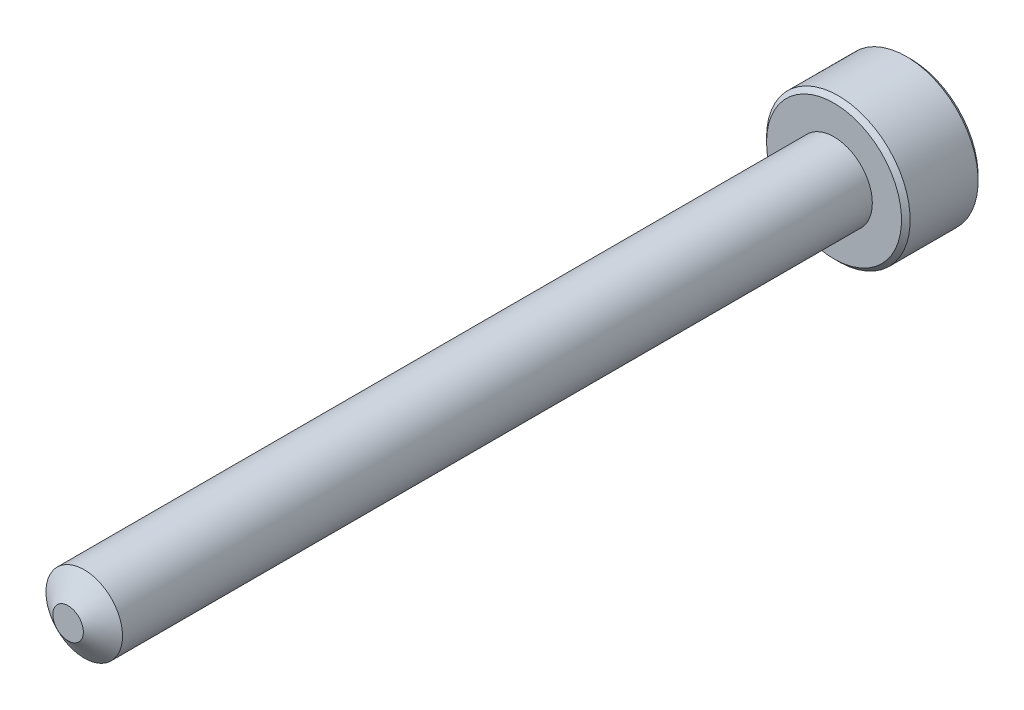
ISO-10303-21;
HEADER;
FILE_DESCRIPTION(('STEP AP214'),'2;1');
FILE_NAME('part.step','',(''),(''),'','','');
FILE_SCHEMA(('AUTOMOTIVE_DESIGN { 1 0 10303 214 1 1 1 1 }'));
ENDSEC;
DATA;
#1=APPLICATION_CONTEXT('core data for automotive mechanical design processes');
#2=APPLICATION_PROTOCOL_DEFINITION('international standard','automotive_design',2000,#1);
#3=PRODUCT_CONTEXT('',#1,'mechanical');
#4=PRODUCT('Part','Part','',(#3));
#5=PRODUCT_RELATED_PRODUCT_CATEGORY('part','',(#4));
#6=PRODUCT_DEFINITION_FORMATION('','',#4);
#7=PRODUCT_DEFINITION_CONTEXT('part definition',#1,'design');
#8=PRODUCT_DEFINITION('design','',#6,#7);
#9=PRODUCT_DEFINITION_SHAPE('','',#8);
#10=(LENGTH_UNIT() NAMED_UNIT(*) SI_UNIT(.MILLI.,.METRE.));
#11=(NAMED_UNIT(*) PLANE_ANGLE_UNIT() SI_UNIT($,.RADIAN.));
#12=(NAMED_UNIT(*) SI_UNIT($,.STERADIAN.) SOLID_ANGLE_UNIT());
#13=UNCERTAINTY_MEASURE_WITH_UNIT(LENGTH_MEASURE(1.E-05),#10,'distance_accuracy_value','');
#14=(GEOMETRIC_REPRESENTATION_CONTEXT(3) GLOBAL_UNCERTAINTY_ASSIGNED_CONTEXT((#13)) GLOBAL_UNIT_ASSIGNED_CONTEXT((#10,
#11,#12)) REPRESENTATION_CONTEXT('',''));
#15=CARTESIAN_POINT('',(0.,0.,0.));
#16=DIRECTION('',(0.,0.,1.));
#17=DIRECTION('',(1.,0.,0.));
#18=AXIS2_PLACEMENT_3D('',#15,#16,#17);
#19=CARTESIAN_POINT('',(0.,0.,-16.));
#20=DIRECTION('',(0.,0.,1.));
#21=DIRECTION('',(1.,0.,0.));
#22=AXIS2_PLACEMENT_3D('',#19,#20,#21);
#23=CYLINDRICAL_SURFACE('',#22,0.799999999999999);
#24=CARTESIAN_POINT('',(0.,0.,-0.337032062658148));
#25=DIRECTION('',(0.,0.,1.));
#26=DIRECTION('',(1.,0.,0.));
#27=AXIS2_PLACEMENT_3D('',#24,#25,#26);
#28=CIRCLE('',#27,0.799999999999999);
#29=CARTESIAN_POINT('',(0.799999999999999,0.,-0.337032062658148));
#30=VERTEX_POINT('',#29);
#31=EDGE_CURVE('E112',#30,#30,#28,.T.);
#32=ORIENTED_EDGE('',*,*,#31,.F.);
#33=EDGE_LOOP('',(#32));
#34=FACE_BOUND('',#33,.T.);
#35=CARTESIAN_POINT('',(0.,0.,-16.));
#36=DIRECTION('',(0.,0.,-1.));
#37=DIRECTION('',(-1.,0.,0.));
#38=AXIS2_PLACEMENT_3D('',#35,#36,#37);
#39=CIRCLE('',#38,0.799999999999999);
#40=CARTESIAN_POINT('',(-0.799999999999999,0.,-16.));
#41=VERTEX_POINT('',#40);
#42=EDGE_CURVE('E218',#41,#41,#39,.F.);
#43=ORIENTED_EDGE('',*,*,#42,.T.);
#44=EDGE_LOOP('',(#43));
#45=FACE_BOUND('',#44,.T.);
#46=ADVANCED_FACE('F38',(#34,#45),#23,.T.);
#47=CARTESIAN_POINT('',(0.,0.,0.));
#48=DIRECTION('',(0.,0.,-1.));
#49=DIRECTION('',(-1.,0.,0.));
#50=AXIS2_PLACEMENT_3D('',#47,#48,#49);
#51=CONICAL_SURFACE('',#50,0.318668331506579,0.959931088596884);
#52=ORIENTED_EDGE('',*,*,#31,.T.);
#53=EDGE_LOOP('',(#52));
#54=FACE_BOUND('',#53,.T.);
#55=CARTESIAN_POINT('',(0.,0.,0.));
#56=DIRECTION('',(0.,0.,1.));
#57=DIRECTION('',(1.,0.,0.));
#58=AXIS2_PLACEMENT_3D('',#55,#56,#57);
#59=CIRCLE('',#58,0.318668331506579);
#60=CARTESIAN_POINT('',(0.318668331506579,0.,0.));
#61=VERTEX_POINT('',#60);
#62=EDGE_CURVE('E216',#61,#61,#59,.T.);
#63=ORIENTED_EDGE('',*,*,#62,.F.);
#64=EDGE_LOOP('',(#63));
#65=FACE_BOUND('',#64,.T.);
#66=ADVANCED_FACE('F199',(#54,#65),#51,.T.);
#67=CARTESIAN_POINT('',(0.,0.,0.));
#68=DIRECTION('',(0.,0.,1.));
#69=DIRECTION('',(1.,0.,0.));
#70=AXIS2_PLACEMENT_3D('',#67,#68,#69);
#71=PLANE('',#70);
#72=ORIENTED_EDGE('',*,*,#62,.T.);
#73=EDGE_LOOP('',(#72));
#74=FACE_BOUND('',#73,.T.);
#75=ADVANCED_FACE('F196',(#74),#71,.T.);
#76=CARTESIAN_POINT('',(0.,0.,-17.6));
#77=DIRECTION('',(0.,0.,1.));
#78=DIRECTION('',(1.,0.,0.));
#79=AXIS2_PLACEMENT_3D('',#76,#77,#78);
#80=CYLINDRICAL_SURFACE('',#79,1.5);
#81=CARTESIAN_POINT('',(0.,0.,-17.51));
#82=DIRECTION('',(0.,0.,-1.));
#83=DIRECTION('',(-1.,0.,0.));
#84=AXIS2_PLACEMENT_3D('',#81,#82,#83);
#85=CIRCLE('',#84,1.5);
#86=CARTESIAN_POINT('',(-1.5,0.,-17.51));
#87=VERTEX_POINT('',#86);
#88=EDGE_CURVE('E46',#87,#87,#85,.F.);
#89=ORIENTED_EDGE('',*,*,#88,.T.);
#90=EDGE_LOOP('',(#89));
#91=FACE_BOUND('',#90,.T.);
#92=CARTESIAN_POINT('',(0.,0.,-16.09));
#93=DIRECTION('',(0.,0.,-1.));
#94=DIRECTION('',(-1.,0.,0.));
#95=AXIS2_PLACEMENT_3D('',#92,#93,#94);
#96=CIRCLE('',#95,1.5);
#97=CARTESIAN_POINT('',(-1.5,0.,-16.09));
#98=VERTEX_POINT('',#97);
#99=EDGE_CURVE('E175',#98,#98,#96,.T.);
#100=ORIENTED_EDGE('',*,*,#99,.T.);
#101=EDGE_LOOP('',(#100));
#102=FACE_BOUND('',#101,.T.);
#103=ADVANCED_FACE('F180',(#91,#102),#80,.T.);
#104=CARTESIAN_POINT('',(0.,0.,-17.6));
#105=DIRECTION('',(0.,0.,-1.));
#106=DIRECTION('',(-1.,0.,0.));
#107=AXIS2_PLACEMENT_3D('',#104,#105,#106);
#108=PLANE('',#107);
#109=CARTESIAN_POINT('',(0.,0.,-17.6));
#110=DIRECTION('',(0.,0.,-1.));
#111=DIRECTION('',(-1.,0.,0.));
#112=AXIS2_PLACEMENT_3D('',#109,#110,#111);
#113=CIRCLE('',#112,1.41);
#114=CARTESIAN_POINT('',(-1.41,0.,-17.6));
#115=VERTEX_POINT('',#114);
#116=EDGE_CURVE('E111',#115,#115,#113,.T.);
#117=ORIENTED_EDGE('',*,*,#116,.T.);
#118=EDGE_LOOP('',(#117));
#119=FACE_BOUND('',#118,.T.);
#120=CARTESIAN_POINT('',(0.,0.,-17.6));
#121=DIRECTION('',(0.,0.,-1.));
#122=DIRECTION('',(-1.,0.,0.));
#123=AXIS2_PLACEMENT_3D('',#120,#121,#122);
#124=CIRCLE('',#123,0.866025403784439);
#125=CARTESIAN_POINT('',(-0.749999999999989,0.433012701892241,-17.6));
#126=VERTEX_POINT('',#125);
#127=CARTESIAN_POINT('',(0.,0.86602540378444,-17.6));
#128=VERTEX_POINT('',#127);
#129=EDGE_CURVE('E92',#126,#128,#124,.T.);
#130=ORIENTED_EDGE('',*,*,#129,.F.);
#131=CARTESIAN_POINT('',(-0.749999999999989,-0.433012701892221,-17.6));
#132=VERTEX_POINT('',#131);
#133=EDGE_CURVE('E52',#132,#126,#124,.T.);
#134=ORIENTED_EDGE('',*,*,#133,.F.);
#135=CARTESIAN_POINT('',(0.,-0.866025403784439,-17.6));
#136=VERTEX_POINT('',#135);
#137=EDGE_CURVE('E278',#136,#132,#124,.T.);
#138=ORIENTED_EDGE('',*,*,#137,.F.);
#139=CARTESIAN_POINT('',(0.749999999999995,-0.433012701892229,-17.6));
#140=VERTEX_POINT('',#139);
#141=EDGE_CURVE('E59',#140,#136,#124,.T.);
#142=ORIENTED_EDGE('',*,*,#141,.F.);
#143=CARTESIAN_POINT('',(0.749999999999999,0.433012701892223,-17.6));
#144=VERTEX_POINT('',#143);
#145=EDGE_CURVE('E133',#144,#140,#124,.T.);
#146=ORIENTED_EDGE('',*,*,#145,.F.);
#147=EDGE_CURVE('E101',#128,#144,#124,.T.);
#148=ORIENTED_EDGE('',*,*,#147,.F.);
#149=EDGE_LOOP('',(#130,#134,#138,#142,#146,#148));
#150=FACE_BOUND('',#149,.T.);
#151=ADVANCED_FACE('F132',(#119,#150),#108,.T.);
#152=CARTESIAN_POINT('',(0.,0.,-16.));
#153=DIRECTION('',(0.,0.,-1.));
#154=DIRECTION('',(-1.,0.,0.));
#155=AXIS2_PLACEMENT_3D('',#152,#153,#154);
#156=PLANE('',#155);
#157=CARTESIAN_POINT('',(0.,0.,-16.));
#158=DIRECTION('',(0.,0.,-1.));
#159=DIRECTION('',(-1.,0.,0.));
#160=AXIS2_PLACEMENT_3D('',#157,#158,#159);
#161=CIRCLE('',#160,1.41);
#162=CARTESIAN_POINT('',(-1.41,0.,-16.));
#163=VERTEX_POINT('',#162);
#164=EDGE_CURVE('E11',#163,#163,#161,.F.);
#165=ORIENTED_EDGE('',*,*,#164,.T.);
#166=EDGE_LOOP('',(#165));
#167=FACE_BOUND('',#166,.T.);
#168=ORIENTED_EDGE('',*,*,#42,.F.);
#169=EDGE_LOOP('',(#168));
#170=FACE_BOUND('',#169,.T.);
#171=ADVANCED_FACE('F189',(#167,#170),#156,.F.);
#172=CARTESIAN_POINT('',(0.,0.,-17.6));
#173=DIRECTION('',(0.,0.,-1.));
#174=DIRECTION('',(-1.,0.,0.));
#175=AXIS2_PLACEMENT_3D('',#172,#173,#174);
#176=CONICAL_SURFACE('',#175,0.866025403784439,0.78539816339745);
#177=ORIENTED_EDGE('',*,*,#147,.T.);
#178=CARTESIAN_POINT('',(-0.000199999999998027,0.866140873838277,-17.6001154931448));
#179=CARTESIAN_POINT('',(0.0255899625576833,0.85125103201321,-17.5852341104639));
#180=CARTESIAN_POINT('',(0.0518112021286608,0.83611219228842,-17.571226265607));
#181=CARTESIAN_POINT('',(0.105279708235708,0.80524213589435,-17.5455775246823));
#182=CARTESIAN_POINT('',(0.132532067460574,0.789507978959821,-17.5339509117057));
#183=CARTESIAN_POINT('',(0.187485350381354,0.757780686272655,-17.5140340457722));
#184=CARTESIAN_POINT('',(0.215172256695511,0.741795643459148,-17.5056936940814));
#185=CARTESIAN_POINT('',(0.271155595130854,0.709473647943369,-17.4928427419614));
#186=CARTESIAN_POINT('',(0.299450314843645,0.693137683900544,-17.4883225405888));
#187=CARTESIAN_POINT('',(0.348210289268843,0.664986099540477,-17.4842458330974));
#188=CARTESIAN_POINT('',(0.368612065655573,0.653207128451652,-17.4836427966141));
#189=CARTESIAN_POINT('',(0.40937613469636,0.629671982217689,-17.4846545060155));
#190=CARTESIAN_POINT('',(0.429738417651455,0.617915812672249,-17.48626974099));
#191=CARTESIAN_POINT('',(0.490534543086824,0.582815153286453,-17.494336146973));
#192=CARTESIAN_POINT('',(0.5306658549961,0.5596453295527,-17.5040089358277));
#193=CARTESIAN_POINT('',(0.601110400354025,0.518974152327361,-17.5273563179723));
#194=CARTESIAN_POINT('',(0.631753572009085,0.501282308923488,-17.5398085580723));
#195=CARTESIAN_POINT('',(0.691839345804786,0.466591771248073,-17.5678596102309));
#196=CARTESIAN_POINT('',(0.721285488381586,0.449591032904762,-17.5834481859037));
#197=CARTESIAN_POINT('',(0.750199999999994,0.432897231838388,-17.6001154931448));
#198=B_SPLINE_CURVE_WITH_KNOTS('',3,(#178,#179,#180,#181,#182,#183,#184,#185,#186,#187,#188,
#189,#190,#191,#192,#193,#194,#195,#196,#197),.UNSPECIFIED.,.F.,.F.,(4,2,2,2,2,2,2,2,2,4),(0.,
0.0999419466095595,0.200466857654446,0.299393763705716,0.398071297300228,0.468665775681745,
0.539275821398837,0.680536257244565,0.792918418368068,0.904939568716021),.UNSPECIFIED.);
#199=EDGE_CURVE('E106',#128,#144,#198,.T.);
#200=ORIENTED_EDGE('',*,*,#199,.F.);
#201=EDGE_LOOP('',(#177,#200));
#202=FACE_BOUND('',#201,.T.);
#203=ADVANCED_FACE('F107',(#202),#176,.F.);
#204=ORIENTED_EDGE('',*,*,#145,.T.);
#205=CARTESIAN_POINT('',(0.749999999999995,-0.863604064848461,-17.8777892581354));
#206=CARTESIAN_POINT('',(0.749999999999995,-0.842575879734331,-17.8619149320084));
#207=CARTESIAN_POINT('',(0.749999999999995,-0.821430496291559,-17.846196265183));
#208=CARTESIAN_POINT('',(0.749999999999995,-0.778857857419017,-17.8151345206266));
#209=CARTESIAN_POINT('',(0.749999999999995,-0.757430533042235,-17.7997915374936));
#210=CARTESIAN_POINT('',(0.749999999999995,-0.692340710712935,-17.7542035802937));
#211=CARTESIAN_POINT('',(0.749999999999995,-0.648190081053413,-17.7246440917434));
#212=CARTESIAN_POINT('',(0.749999999999995,-0.55560718150175,-17.6666155826928));
#213=CARTESIAN_POINT('',(0.749999999999995,-0.507074363017995,-17.6383051093658));
#214=CARTESIAN_POINT('',(0.749999999999995,-0.407587529772336,-17.5865181117689));
#215=CARTESIAN_POINT('',(0.749999999999995,-0.356642419548471,-17.5630252915319));
#216=CARTESIAN_POINT('',(0.749999999999995,-0.280165468820771,-17.5342868995007));
#217=CARTESIAN_POINT('',(0.749999999999995,-0.255770023930572,-17.5260392748131));
#218=CARTESIAN_POINT('',(0.749999999999995,-0.206403277885132,-17.5114971754202));
#219=CARTESIAN_POINT('',(0.749999999999995,-0.181431937185907,-17.5052028352691));
#220=CARTESIAN_POINT('',(0.749999999999995,-0.106699879404925,-17.4899931738806));
#221=CARTESIAN_POINT('',(0.749999999999995,-0.056190717176218,-17.4843771847129));
#222=CARTESIAN_POINT('',(0.749999999999995,0.0430767231749055,-17.4836282564543));
#223=CARTESIAN_POINT('',(0.749999999999995,0.0918322434166276,-17.4881234514056));
#224=CARTESIAN_POINT('',(0.749999999999995,0.164112195698293,-17.501337307446));
#225=CARTESIAN_POINT('',(0.749999999999995,0.188278676879435,-17.5069014463821));
#226=CARTESIAN_POINT('',(0.749999999999995,0.23609448012033,-17.5199231661487));
#227=CARTESIAN_POINT('',(0.749999999999995,0.25974384527304,-17.5273805885477));
#228=CARTESIAN_POINT('',(0.749999999999995,0.334198278463818,-17.5536664694661));
#229=CARTESIAN_POINT('',(0.749999999999995,0.383940060445493,-17.5754903380484));
#230=CARTESIAN_POINT('',(0.749999999999995,0.481089225076663,-17.6240118041006));
#231=CARTESIAN_POINT('',(0.749999999999995,0.528487417973013,-17.6507269113103));
#232=CARTESIAN_POINT('',(0.749999999999995,0.619071540465247,-17.7058428511508));
#233=CARTESIAN_POINT('',(0.749999999999995,0.662349745300235,-17.7340939454522));
#234=CARTESIAN_POINT('',(0.749999999999995,0.726111623216221,-17.7777671470975));
#235=CARTESIAN_POINT('',(0.749999999999995,0.747090419255276,-17.7924788605167));
#236=CARTESIAN_POINT('',(0.749999999999995,0.788761341501856,-17.8222913841024));
#237=CARTESIAN_POINT('',(0.749999999999995,0.809453544535616,-17.837392086763));
#238=CARTESIAN_POINT('',(0.749999999999995,0.830026390097466,-17.8526540893047));
#239=B_SPLINE_CURVE_WITH_KNOTS('',3,(#205,#206,#207,#208,#209,#210,#211,#212,#213,#214,#215,
#216,#217,#218,#219,#220,#221,#222,#223,#224,#225,#226,#227,#228,#229,#230,#231,#232,#233,#234,
#235,#236,#237,#238),.UNSPECIFIED.,.F.,.F.,(4,2,2,2,2,2,2,2,2,2,2,2,2,2,2,2,4),(0.,
0.0790398443124695,0.158099390497593,0.317425208674101,0.485845155681378,0.653685658303956,
0.730869805636065,0.808059268704008,0.959469653380779,1.10540290447489,1.17973203111653,
1.25405493988072,1.41653726506053,1.57961304287542,1.73458511695815,1.81145152932466,
1.8882969211581),.UNSPECIFIED.);
#240=EDGE_CURVE('E100',#144,#140,#239,.F.);
#241=ORIENTED_EDGE('',*,*,#240,.F.);
#242=EDGE_LOOP('',(#204,#241));
#243=FACE_BOUND('',#242,.T.);
#244=ADVANCED_FACE('F284',(#243),#176,.F.);
#245=ORIENTED_EDGE('',*,*,#141,.T.);
#246=CARTESIAN_POINT('',(0.750199999999995,-0.432897231838378,-17.6001154931448));
#247=CARTESIAN_POINT('',(0.724410037442314,-0.447787073663446,-17.5852341104639));
#248=CARTESIAN_POINT('',(0.698188797871336,-0.462925913388236,-17.571226265607));
#249=CARTESIAN_POINT('',(0.64472029176429,-0.493795969782306,-17.5455775246823));
#250=CARTESIAN_POINT('',(0.617467932539423,-0.509530126716835,-17.5339509117057));
#251=CARTESIAN_POINT('',(0.562514649618644,-0.541257419404001,-17.5140340457722));
#252=CARTESIAN_POINT('',(0.534827743304488,-0.557242462217507,-17.5056936940814));
#253=CARTESIAN_POINT('',(0.478844404869145,-0.589564457733286,-17.4928427419614));
#254=CARTESIAN_POINT('',(0.450549685156353,-0.605900421776112,-17.4883225405888));
#255=CARTESIAN_POINT('',(0.401789710731155,-0.634052006136179,-17.4842458330974));
#256=CARTESIAN_POINT('',(0.381387934344426,-0.645830977225004,-17.4836427966141));
#257=CARTESIAN_POINT('',(0.340623865303638,-0.669366123458967,-17.4846545060155));
#258=CARTESIAN_POINT('',(0.320261582348544,-0.681122293004407,-17.48626974099));
#259=CARTESIAN_POINT('',(0.259465456913175,-0.716222952390203,-17.494336146973));
#260=CARTESIAN_POINT('',(0.2193341450039,-0.739392776123955,-17.5040089358277));
#261=CARTESIAN_POINT('',(0.148889599645974,-0.780063953349295,-17.5273563179723));
#262=CARTESIAN_POINT('',(0.118246427990914,-0.797755796753168,-17.5398085580722));
#263=CARTESIAN_POINT('',(0.0581606541952107,-0.832446334428584,-17.5678596102309));
#264=CARTESIAN_POINT('',(0.0287145116184097,-0.849447072771896,-17.5834481859037));
#265=CARTESIAN_POINT('',(-0.000199999999999266,-0.866140873838271,-17.6001154931448));
#266=B_SPLINE_CURVE_WITH_KNOTS('',3,(#246,#247,#248,#249,#250,#251,#252,#253,#254,#255,#256,
#257,#258,#259,#260,#261,#262,#263,#264,#265),.UNSPECIFIED.,.F.,.F.,(4,2,2,2,2,2,2,2,2,4),(0.,
0.0999419466095599,0.200466857654446,0.299393763705715,0.398071297300228,0.468665775681745,
0.539275821398836,0.680536257244562,0.792918418368068,0.904939568716026),.UNSPECIFIED.);
#267=EDGE_CURVE('E143',#140,#136,#266,.T.);
#268=ORIENTED_EDGE('',*,*,#267,.F.);
#269=EDGE_LOOP('',(#245,#268));
#270=FACE_BOUND('',#269,.T.);
#271=ADVANCED_FACE('F281',(#270),#176,.F.);
#272=ORIENTED_EDGE('',*,*,#137,.T.);
#273=CARTESIAN_POINT('',(0.000199999999999444,-0.866140873838272,-17.6001154931448));
#274=CARTESIAN_POINT('',(-0.025589962557682,-0.851251032013204,-17.5852341104639));
#275=CARTESIAN_POINT('',(-0.0518112021286595,-0.836112192288414,-17.571226265607));
#276=CARTESIAN_POINT('',(-0.105279708235706,-0.805242135894344,-17.5455775246823));
#277=CARTESIAN_POINT('',(-0.132532067460572,-0.789507978959815,-17.5339509117057));
#278=CARTESIAN_POINT('',(-0.187485350381353,-0.757780686272649,-17.5140340457722));
#279=CARTESIAN_POINT('',(-0.215172256695509,-0.741795643459143,-17.5056936940814));
#280=CARTESIAN_POINT('',(-0.271155595130852,-0.709473647943363,-17.4928427419614));
#281=CARTESIAN_POINT('',(-0.299450314843644,-0.693137683900538,-17.4883225405888));
#282=CARTESIAN_POINT('',(-0.348210289268842,-0.664986099540471,-17.4842458330974));
#283=CARTESIAN_POINT('',(-0.368612065655571,-0.653207128451646,-17.4836427966141));
#284=CARTESIAN_POINT('',(-0.409376134696359,-0.629671982217683,-17.4846545060155));
#285=CARTESIAN_POINT('',(-0.429738417651454,-0.617915812672243,-17.48626974099));
#286=CARTESIAN_POINT('',(-0.490534543086822,-0.582815153286447,-17.494336146973));
#287=CARTESIAN_POINT('',(-0.530665854996097,-0.559645329552695,-17.5040089358277));
#288=CARTESIAN_POINT('',(-0.601110400354022,-0.518974152327356,-17.5273563179723));
#289=CARTESIAN_POINT('',(-0.631753572009081,-0.501282308923483,-17.5398085580722));
#290=CARTESIAN_POINT('',(-0.691839345804781,-0.466591771248069,-17.5678596102309));
#291=CARTESIAN_POINT('',(-0.72128548838158,-0.449591032904758,-17.5834481859037));
#292=CARTESIAN_POINT('',(-0.750199999999988,-0.432897231838384,-17.6001154931448));
#293=B_SPLINE_CURVE_WITH_KNOTS('',3,(#273,#274,#275,#276,#277,#278,#279,#280,#281,#282,#283,
#284,#285,#286,#287,#288,#289,#290,#291,#292),.UNSPECIFIED.,.F.,.F.,(4,2,2,2,2,2,2,2,2,4),(0.,
0.0999419466095579,0.200466857654444,0.299393763705716,0.398071297300228,0.468665775681745,
0.539275821398836,0.680536257244562,0.792918418368064,0.904939568716016),.UNSPECIFIED.);
#294=EDGE_CURVE('E255',#136,#132,#293,.T.);
#295=ORIENTED_EDGE('',*,*,#294,.F.);
#296=EDGE_LOOP('',(#272,#295));
#297=FACE_BOUND('',#296,.T.);
#298=ADVANCED_FACE('F280',(#297),#176,.F.);
#299=ORIENTED_EDGE('',*,*,#133,.T.);
#300=CARTESIAN_POINT('',(-0.749999999999989,-0.863604064848471,-17.8777892581354));
#301=CARTESIAN_POINT('',(-0.749999999999989,-0.842575879734343,-17.8619149320084));
#302=CARTESIAN_POINT('',(-0.749999999999989,-0.821430496291571,-17.846196265183));
#303=CARTESIAN_POINT('',(-0.749999999999989,-0.77885785741903,-17.8151345206266));
#304=CARTESIAN_POINT('',(-0.749999999999989,-0.757430533042247,-17.7997915374936));
#305=CARTESIAN_POINT('',(-0.749999999999989,-0.692340710712945,-17.7542035802937));
#306=CARTESIAN_POINT('',(-0.749999999999989,-0.648190081053423,-17.7246440917434));
#307=CARTESIAN_POINT('',(-0.749999999999989,-0.555607181501759,-17.6666155826928));
#308=CARTESIAN_POINT('',(-0.749999999999989,-0.507074363018004,-17.6383051093658));
#309=CARTESIAN_POINT('',(-0.749999999999989,-0.407587529772343,-17.5865181117689));
#310=CARTESIAN_POINT('',(-0.749999999999989,-0.356642419548477,-17.5630252915318));
#311=CARTESIAN_POINT('',(-0.749999999999989,-0.280165468820776,-17.5342868995007));
#312=CARTESIAN_POINT('',(-0.749999999999989,-0.255770023930577,-17.526039274813));
#313=CARTESIAN_POINT('',(-0.749999999999989,-0.206403277885137,-17.5114971754202));
#314=CARTESIAN_POINT('',(-0.749999999999989,-0.181431937185912,-17.5052028352691));
#315=CARTESIAN_POINT('',(-0.749999999999989,-0.106699879404929,-17.4899931738806));
#316=CARTESIAN_POINT('',(-0.749999999999989,-0.0561907171762219,-17.4843771847129));
#317=CARTESIAN_POINT('',(-0.749999999999989,0.0430767231749017,-17.4836282564543));
#318=CARTESIAN_POINT('',(-0.749999999999989,0.0918322434166239,-17.4881234514056));
#319=CARTESIAN_POINT('',(-0.749999999999989,0.16411219569829,-17.501337307446));
#320=CARTESIAN_POINT('',(-0.749999999999989,0.188278676879432,-17.5069014463821));
#321=CARTESIAN_POINT('',(-0.749999999999989,0.236094480120326,-17.5199231661487));
#322=CARTESIAN_POINT('',(-0.749999999999989,0.259743845273036,-17.5273805885476));
#323=CARTESIAN_POINT('',(-0.749999999999989,0.334198278463814,-17.5536664694661));
#324=CARTESIAN_POINT('',(-0.749999999999989,0.383940060445489,-17.5754903380484));
#325=CARTESIAN_POINT('',(-0.749999999999989,0.481089225076657,-17.6240118041006));
#326=CARTESIAN_POINT('',(-0.749999999999989,0.528487417973007,-17.6507269113103));
#327=CARTESIAN_POINT('',(-0.749999999999989,0.619071540465239,-17.7058428511508));
#328=CARTESIAN_POINT('',(-0.749999999999989,0.662349745300228,-17.7340939454522));
#329=CARTESIAN_POINT('',(-0.749999999999989,0.726111623216211,-17.7777671470975));
#330=CARTESIAN_POINT('',(-0.749999999999989,0.747090419255265,-17.7924788605167));
#331=CARTESIAN_POINT('',(-0.749999999999989,0.788761341501844,-17.8222913841024));
#332=CARTESIAN_POINT('',(-0.749999999999989,0.809453544535604,-17.837392086763));
#333=CARTESIAN_POINT('',(-0.749999999999989,0.830026390097454,-17.8526540893047));
#334=B_SPLINE_CURVE_WITH_KNOTS('',3,(#300,#301,#302,#303,#304,#305,#306,#307,#308,#309,#310,
#311,#312,#313,#314,#315,#316,#317,#318,#319,#320,#321,#322,#323,#324,#325,#326,#327,#328,#329,
#330,#331,#332,#333),.UNSPECIFIED.,.F.,.F.,(4,2,2,2,2,2,2,2,2,2,2,2,2,2,2,2,4),(0.,
0.0790398443124674,0.158099390497591,0.317425208674103,0.485845155681381,0.653685658303964,
0.730869805636072,0.808059268704017,0.959469653380789,1.1054029044749,1.17973203111654,
1.25405493988072,1.41653726506054,1.57961304287543,1.73458511695815,1.81145152932466,
1.8882969211581),.UNSPECIFIED.);
#335=EDGE_CURVE('E122',#132,#126,#334,.T.);
#336=ORIENTED_EDGE('',*,*,#335,.F.);
#337=EDGE_LOOP('',(#299,#336));
#338=FACE_BOUND('',#337,.T.);
#339=ADVANCED_FACE('F293',(#338),#176,.F.);
#340=ORIENTED_EDGE('',*,*,#129,.T.);
#341=CARTESIAN_POINT('',(-0.750199999999989,0.432897231838387,-17.6001154931448));
#342=CARTESIAN_POINT('',(-0.724410037442308,0.447787073663454,-17.5852341104639));
#343=CARTESIAN_POINT('',(-0.698188797871331,0.462925913388244,-17.5712262656069));
#344=CARTESIAN_POINT('',(-0.644720291764285,0.493795969782314,-17.5455775246823));
#345=CARTESIAN_POINT('',(-0.617467932539419,0.509530126716842,-17.5339509117057));
#346=CARTESIAN_POINT('',(-0.56251464961864,0.541257419404008,-17.5140340457722));
#347=CARTESIAN_POINT('',(-0.534827743304484,0.557242462217514,-17.5056936940814));
#348=CARTESIAN_POINT('',(-0.478844404869142,0.589564457733293,-17.4928427419614));
#349=CARTESIAN_POINT('',(-0.450549685156351,0.605900421776118,-17.4883225405888));
#350=CARTESIAN_POINT('',(-0.401789710731153,0.634052006136185,-17.4842458330974));
#351=CARTESIAN_POINT('',(-0.381387934344424,0.64583097722501,-17.4836427966141));
#352=CARTESIAN_POINT('',(-0.340623865303636,0.669366123458973,-17.4846545060155));
#353=CARTESIAN_POINT('',(-0.320261582348541,0.681122293004412,-17.48626974099));
#354=CARTESIAN_POINT('',(-0.259465456913173,0.716222952390209,-17.494336146973));
#355=CARTESIAN_POINT('',(-0.219334145003897,0.739392776123962,-17.5040089358277));
#356=CARTESIAN_POINT('',(-0.148889599645971,0.780063953349301,-17.5273563179723));
#357=CARTESIAN_POINT('',(-0.11824642799091,0.797755796753174,-17.5398085580723));
#358=CARTESIAN_POINT('',(-0.0581606541952074,0.83244633442859,-17.5678596102309));
#359=CARTESIAN_POINT('',(-0.0287145116184069,0.849447072771902,-17.5834481859038));
#360=CARTESIAN_POINT('',(0.000200000000002174,0.866140873838278,-17.6001154931448));
#361=B_SPLINE_CURVE_WITH_KNOTS('',3,(#341,#342,#343,#344,#345,#346,#347,#348,#349,#350,#351,
#352,#353,#354,#355,#356,#357,#358,#359,#360),.UNSPECIFIED.,.F.,.F.,(4,2,2,2,2,2,2,2,2,4),(0.,
0.0999419466095585,0.200466857654441,0.29939376370571,0.398071297300221,0.468665775681739,
0.53927582139883,0.680536257244557,0.792918418368064,0.904939568716021),.UNSPECIFIED.);
#362=EDGE_CURVE('E96',#126,#128,#361,.T.);
#363=ORIENTED_EDGE('',*,*,#362,.F.);
#364=EDGE_LOOP('',(#340,#363));
#365=FACE_BOUND('',#364,.T.);
#366=ADVANCED_FACE('F94',(#365),#176,.F.);
#367=CARTESIAN_POINT('',(-1.49999999999999,0.,-16.475));
#368=DIRECTION('',(0.,0.,1.));
#369=DIRECTION('',(1.,0.,0.));
#370=AXIS2_PLACEMENT_3D('',#367,#368,#369);
#371=PLANE('',#370);
#372=DIRECTION('',(0.866025403784438,0.500000000000001,0.));
#373=VECTOR('',#372,1.);
#374=CARTESIAN_POINT('',(-0.749999999999989,0.433012701892225,-16.475));
#375=LINE('',#374,#373);
#376=CARTESIAN_POINT('',(-0.749999999999989,0.433012701892225,-16.475));
#377=VERTEX_POINT('',#376);
#378=CARTESIAN_POINT('',(0.,0.866025403784439,-16.475));
#379=VERTEX_POINT('',#378);
#380=EDGE_CURVE('E121',#377,#379,#375,.T.);
#381=ORIENTED_EDGE('',*,*,#380,.T.);
#382=DIRECTION('',(0.866025403784439,-0.499999999999999,0.));
#383=VECTOR('',#382,1.);
#384=CARTESIAN_POINT('',(0.,0.866025403784439,-16.475));
#385=LINE('',#384,#383);
#386=CARTESIAN_POINT('',(0.749999999999995,0.433012701892225,-16.475));
#387=VERTEX_POINT('',#386);
#388=EDGE_CURVE('E126',#379,#387,#385,.T.);
#389=ORIENTED_EDGE('',*,*,#388,.T.);
#390=DIRECTION('',(0.,-1.,0.));
#391=VECTOR('',#390,1.);
#392=CARTESIAN_POINT('',(0.749999999999995,0.433012701892225,-16.475));
#393=LINE('',#392,#391);
#394=CARTESIAN_POINT('',(0.749999999999995,-0.433012701892216,-16.475));
#395=VERTEX_POINT('',#394);
#396=EDGE_CURVE('E241',#387,#395,#393,.T.);
#397=ORIENTED_EDGE('',*,*,#396,.T.);
#398=DIRECTION('',(-0.866025403784438,-0.500000000000001,0.));
#399=VECTOR('',#398,1.);
#400=CARTESIAN_POINT('',(0.749999999999995,-0.433012701892216,-16.475));
#401=LINE('',#400,#399);
#402=CARTESIAN_POINT('',(0.,-0.866025403784434,-16.475));
#403=VERTEX_POINT('',#402);
#404=EDGE_CURVE('E238',#395,#403,#401,.T.);
#405=ORIENTED_EDGE('',*,*,#404,.T.);
#406=DIRECTION('',(-0.866025403784439,0.5,0.));
#407=VECTOR('',#406,1.);
#408=CARTESIAN_POINT('',(0.,-0.866025403784434,-16.475));
#409=LINE('',#408,#407);
#410=CARTESIAN_POINT('',(-0.749999999999989,-0.433012701892221,-16.475));
#411=VERTEX_POINT('',#410);
#412=EDGE_CURVE('E235',#403,#411,#409,.T.);
#413=ORIENTED_EDGE('',*,*,#412,.T.);
#414=DIRECTION('',(0.,1.,0.));
#415=VECTOR('',#414,1.);
#416=CARTESIAN_POINT('',(-0.749999999999989,-0.433012701892221,-16.475));
#417=LINE('',#416,#415);
#418=EDGE_CURVE('E129',#411,#377,#417,.T.);
#419=ORIENTED_EDGE('',*,*,#418,.T.);
#420=EDGE_LOOP('',(#381,#389,#397,#405,#413,#419));
#421=FACE_BOUND('',#420,.T.);
#422=ADVANCED_FACE('F163',(#421),#371,.F.);
#423=CARTESIAN_POINT('',(0.,0.866025403784439,-16.475));
#424=DIRECTION('',(0.499999999999999,0.866025403784439,0.));
#425=DIRECTION('',(-0.866025403784439,0.499999999999999,0.));
#426=AXIS2_PLACEMENT_3D('',#423,#424,#425);
#427=PLANE('',#426);
#428=DIRECTION('',(0.,0.,-1.));
#429=VECTOR('',#428,1.);
#430=CARTESIAN_POINT('',(0.,0.866025403784439,-16.475));
#431=LINE('',#430,#429);
#432=EDGE_CURVE('E118',#379,#128,#431,.T.);
#433=ORIENTED_EDGE('',*,*,#432,.T.);
#434=ORIENTED_EDGE('',*,*,#199,.T.);
#435=DIRECTION('',(0.,0.,-1.));
#436=VECTOR('',#435,1.);
#437=CARTESIAN_POINT('',(0.749999999999995,0.433012701892225,-16.475));
#438=LINE('',#437,#436);
#439=EDGE_CURVE('E128',#387,#144,#438,.T.);
#440=ORIENTED_EDGE('',*,*,#439,.F.);
#441=ORIENTED_EDGE('',*,*,#388,.F.);
#442=EDGE_LOOP('',(#433,#434,#440,#441));
#443=FACE_BOUND('',#442,.T.);
#444=ADVANCED_FACE('F124',(#443),#427,.F.);
#445=CARTESIAN_POINT('',(0.749999999999995,0.433012701892225,-16.475));
#446=DIRECTION('',(1.,0.,0.));
#447=DIRECTION('',(0.,0.,-1.));
#448=AXIS2_PLACEMENT_3D('',#445,#446,#447);
#449=PLANE('',#448);
#450=ORIENTED_EDGE('',*,*,#439,.T.);
#451=ORIENTED_EDGE('',*,*,#240,.T.);
#452=DIRECTION('',(0.,0.,-1.));
#453=VECTOR('',#452,1.);
#454=CARTESIAN_POINT('',(0.749999999999995,-0.433012701892216,-16.475));
#455=LINE('',#454,#453);
#456=EDGE_CURVE('E224',#395,#140,#455,.T.);
#457=ORIENTED_EDGE('',*,*,#456,.F.);
#458=ORIENTED_EDGE('',*,*,#396,.F.);
#459=EDGE_LOOP('',(#450,#451,#457,#458));
#460=FACE_BOUND('',#459,.T.);
#461=ADVANCED_FACE('F152',(#460),#449,.F.);
#462=CARTESIAN_POINT('',(0.749999999999995,-0.433012701892216,-16.475));
#463=DIRECTION('',(0.500000000000001,-0.866025403784438,0.));
#464=DIRECTION('',(0.866025403784438,0.500000000000001,0.));
#465=AXIS2_PLACEMENT_3D('',#462,#463,#464);
#466=PLANE('',#465);
#467=ORIENTED_EDGE('',*,*,#456,.T.);
#468=ORIENTED_EDGE('',*,*,#267,.T.);
#469=DIRECTION('',(0.,0.,-1.));
#470=VECTOR('',#469,1.);
#471=CARTESIAN_POINT('',(0.,-0.866025403784434,-16.475));
#472=LINE('',#471,#470);
#473=EDGE_CURVE('E227',#403,#136,#472,.T.);
#474=ORIENTED_EDGE('',*,*,#473,.F.);
#475=ORIENTED_EDGE('',*,*,#404,.F.);
#476=EDGE_LOOP('',(#467,#468,#474,#475));
#477=FACE_BOUND('',#476,.T.);
#478=ADVANCED_FACE('F156',(#477),#466,.F.);
#479=CARTESIAN_POINT('',(0.,-0.866025403784434,-16.475));
#480=DIRECTION('',(-0.5,-0.866025403784439,0.));
#481=DIRECTION('',(0.866025403784439,-0.5,0.));
#482=AXIS2_PLACEMENT_3D('',#479,#480,#481);
#483=PLANE('',#482);
#484=ORIENTED_EDGE('',*,*,#473,.T.);
#485=ORIENTED_EDGE('',*,*,#294,.T.);
#486=DIRECTION('',(0.,0.,-1.));
#487=VECTOR('',#486,1.);
#488=CARTESIAN_POINT('',(-0.749999999999989,-0.433012701892221,-16.475));
#489=LINE('',#488,#487);
#490=EDGE_CURVE('E230',#411,#132,#489,.T.);
#491=ORIENTED_EDGE('',*,*,#490,.F.);
#492=ORIENTED_EDGE('',*,*,#412,.F.);
#493=EDGE_LOOP('',(#484,#485,#491,#492));
#494=FACE_BOUND('',#493,.T.);
#495=ADVANCED_FACE('F263',(#494),#483,.F.);
#496=CARTESIAN_POINT('',(-0.749999999999989,-0.433012701892221,-16.475));
#497=DIRECTION('',(-1.,0.,0.));
#498=DIRECTION('',(0.,0.,1.));
#499=AXIS2_PLACEMENT_3D('',#496,#497,#498);
#500=PLANE('',#499);
#501=ORIENTED_EDGE('',*,*,#490,.T.);
#502=ORIENTED_EDGE('',*,*,#335,.T.);
#503=DIRECTION('',(0.,0.,-1.));
#504=VECTOR('',#503,1.);
#505=CARTESIAN_POINT('',(-0.749999999999989,0.433012701892225,-16.475));
#506=LINE('',#505,#504);
#507=EDGE_CURVE('E120',#377,#126,#506,.T.);
#508=ORIENTED_EDGE('',*,*,#507,.F.);
#509=ORIENTED_EDGE('',*,*,#418,.F.);
#510=EDGE_LOOP('',(#501,#502,#508,#509));
#511=FACE_BOUND('',#510,.T.);
#512=ADVANCED_FACE('F260',(#511),#500,.F.);
#513=CARTESIAN_POINT('',(-0.749999999999989,0.433012701892225,-16.475));
#514=DIRECTION('',(-0.500000000000001,0.866025403784438,0.));
#515=DIRECTION('',(-0.866025403784438,-0.500000000000001,0.));
#516=AXIS2_PLACEMENT_3D('',#513,#514,#515);
#517=PLANE('',#516);
#518=ORIENTED_EDGE('',*,*,#507,.T.);
#519=ORIENTED_EDGE('',*,*,#362,.T.);
#520=ORIENTED_EDGE('',*,*,#432,.F.);
#521=ORIENTED_EDGE('',*,*,#380,.F.);
#522=EDGE_LOOP('',(#518,#519,#520,#521));
#523=FACE_BOUND('',#522,.T.);
#524=ADVANCED_FACE('F116',(#523),#517,.F.);
#525=CARTESIAN_POINT('',(0.,0.,-17.6));
#526=DIRECTION('',(0.,0.,1.));
#527=DIRECTION('',(1.,0.,0.));
#528=AXIS2_PLACEMENT_3D('',#525,#526,#527);
#529=CONICAL_SURFACE('',#528,1.41,0.785398163397457);
#530=ORIENTED_EDGE('',*,*,#88,.F.);
#531=EDGE_LOOP('',(#530));
#532=FACE_BOUND('',#531,.T.);
#533=ORIENTED_EDGE('',*,*,#116,.F.);
#534=EDGE_LOOP('',(#533));
#535=FACE_BOUND('',#534,.T.);
#536=ADVANCED_FACE('F183',(#532,#535),#529,.T.);
#537=CARTESIAN_POINT('',(0.,0.,-16.09));
#538=DIRECTION('',(0.,0.,-1.));
#539=DIRECTION('',(-1.,0.,0.));
#540=AXIS2_PLACEMENT_3D('',#537,#538,#539);
#541=CONICAL_SURFACE('',#540,1.5,0.785398163397439);
#542=ORIENTED_EDGE('',*,*,#164,.F.);
#543=EDGE_LOOP('',(#542));
#544=FACE_BOUND('',#543,.T.);
#545=ORIENTED_EDGE('',*,*,#99,.F.);
#546=EDGE_LOOP('',(#545));
#547=FACE_BOUND('',#546,.T.);
#548=ADVANCED_FACE('F40',(#544,#547),#541,.T.);
#549=CLOSED_SHELL('',(#46,#66,#75,#103,#151,#171,#203,#244,#271,#298,#339,#366,#422,#444,#461,
#478,#495,#512,#524,#536,#548));
#550=MANIFOLD_SOLID_BREP('B2',#549);
#551=ADVANCED_BREP_SHAPE_REPRESENTATION('',(#18,#550),#14);
#552=SHAPE_DEFINITION_REPRESENTATION(#9,#551);
ENDSEC;
END-ISO-10303-21;
